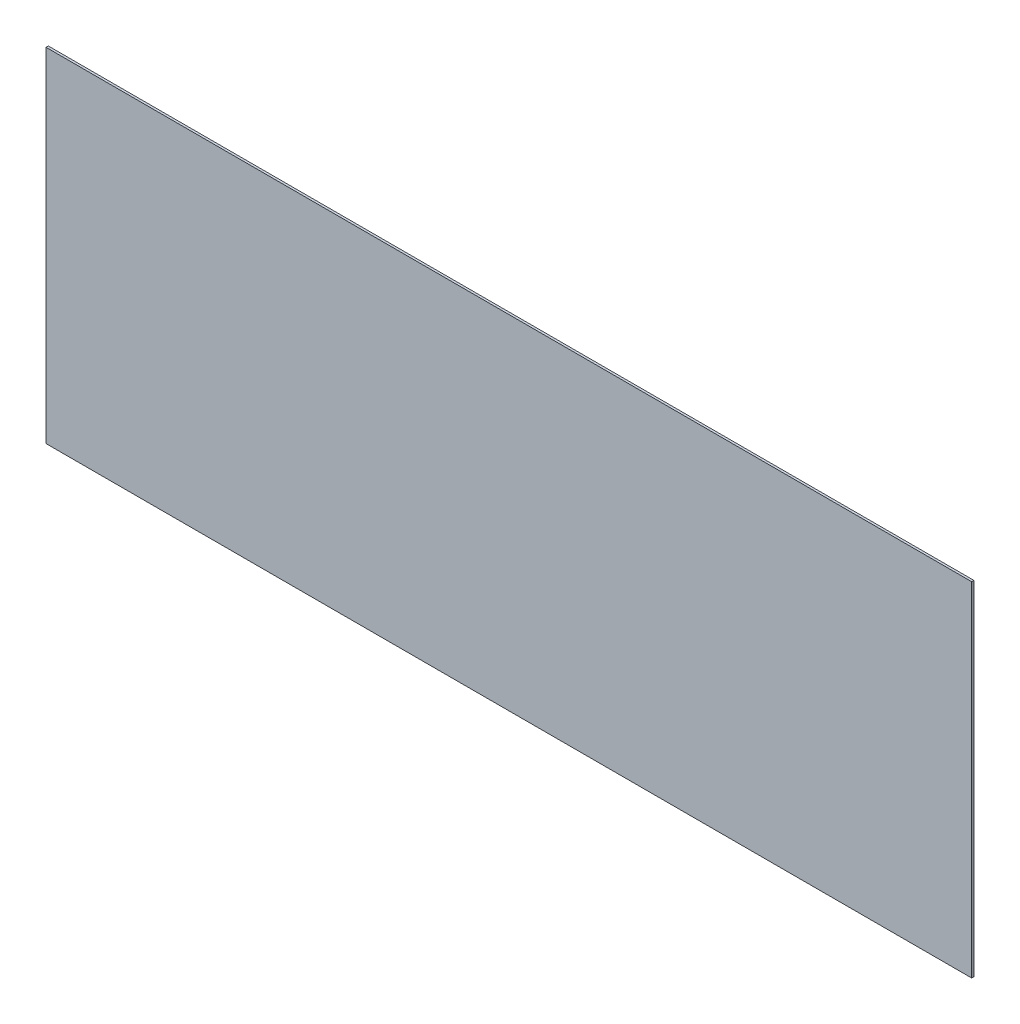
ISO-10303-21;
HEADER;
FILE_DESCRIPTION(('STEP AP214'),'2;1');
FILE_NAME('part.step','',(''),(''),'','','');
FILE_SCHEMA(('AUTOMOTIVE_DESIGN { 1 0 10303 214 1 1 1 1 }'));
ENDSEC;
DATA;
#1=APPLICATION_CONTEXT('core data for automotive mechanical design processes');
#2=APPLICATION_PROTOCOL_DEFINITION('international standard','automotive_design',2000,#1);
#3=PRODUCT_CONTEXT('',#1,'mechanical');
#4=PRODUCT('Part','Part','',(#3));
#5=PRODUCT_RELATED_PRODUCT_CATEGORY('part','',(#4));
#6=PRODUCT_DEFINITION_FORMATION('','',#4);
#7=PRODUCT_DEFINITION_CONTEXT('part definition',#1,'design');
#8=PRODUCT_DEFINITION('design','',#6,#7);
#9=PRODUCT_DEFINITION_SHAPE('','',#8);
#10=(LENGTH_UNIT() NAMED_UNIT(*) SI_UNIT(.MILLI.,.METRE.));
#11=(NAMED_UNIT(*) PLANE_ANGLE_UNIT() SI_UNIT($,.RADIAN.));
#12=(NAMED_UNIT(*) SI_UNIT($,.STERADIAN.) SOLID_ANGLE_UNIT());
#13=UNCERTAINTY_MEASURE_WITH_UNIT(LENGTH_MEASURE(1.E-05),#10,'distance_accuracy_value','');
#14=(GEOMETRIC_REPRESENTATION_CONTEXT(3) GLOBAL_UNCERTAINTY_ASSIGNED_CONTEXT((#13)) GLOBAL_UNIT_ASSIGNED_CONTEXT((#10,
#11,#12)) REPRESENTATION_CONTEXT('',''));
#15=CARTESIAN_POINT('',(0.,0.,0.));
#16=DIRECTION('',(0.,0.,1.));
#17=DIRECTION('',(1.,0.,0.));
#18=AXIS2_PLACEMENT_3D('',#15,#16,#17);
#19=CARTESIAN_POINT('',(609.6,226.06,2.9972));
#20=DIRECTION('',(-1.,0.,0.));
#21=DIRECTION('',(0.,0.,1.));
#22=AXIS2_PLACEMENT_3D('',#19,#20,#21);
#23=PLANE('',#22);
#24=DIRECTION('',(0.,1.,0.));
#25=VECTOR('',#24,1.);
#26=CARTESIAN_POINT('',(609.6,226.06,0.));
#27=LINE('',#26,#25);
#28=CARTESIAN_POINT('',(609.6,-226.06,0.));
#29=VERTEX_POINT('',#28);
#30=CARTESIAN_POINT('',(609.6,226.06,0.));
#31=VERTEX_POINT('',#30);
#32=EDGE_CURVE('E107',#29,#31,#27,.T.);
#33=ORIENTED_EDGE('',*,*,#32,.T.);
#34=DIRECTION('',(0.,0.,-1.));
#35=VECTOR('',#34,1.);
#36=CARTESIAN_POINT('',(609.6,226.06,2.9972));
#37=LINE('',#36,#35);
#38=CARTESIAN_POINT('',(609.6,226.06,2.9972));
#39=VERTEX_POINT('',#38);
#40=EDGE_CURVE('E11',#39,#31,#37,.T.);
#41=ORIENTED_EDGE('',*,*,#40,.F.);
#42=DIRECTION('',(0.,1.,0.));
#43=VECTOR('',#42,1.);
#44=CARTESIAN_POINT('',(609.6,226.06,2.9972));
#45=LINE('',#44,#43);
#46=CARTESIAN_POINT('',(609.6,-226.06,2.9972));
#47=VERTEX_POINT('',#46);
#48=EDGE_CURVE('E91',#47,#39,#45,.T.);
#49=ORIENTED_EDGE('',*,*,#48,.F.);
#50=DIRECTION('',(0.,0.,-1.));
#51=VECTOR('',#50,1.);
#52=CARTESIAN_POINT('',(609.6,-226.06,2.9972));
#53=LINE('',#52,#51);
#54=EDGE_CURVE('E103',#47,#29,#53,.T.);
#55=ORIENTED_EDGE('',*,*,#54,.T.);
#56=EDGE_LOOP('',(#33,#41,#49,#55));
#57=FACE_BOUND('',#56,.T.);
#58=ADVANCED_FACE('F39',(#57),#23,.F.);
#59=CARTESIAN_POINT('',(-609.6,226.06,2.9972));
#60=DIRECTION('',(0.,-1.,0.));
#61=DIRECTION('',(0.,0.,-1.));
#62=AXIS2_PLACEMENT_3D('',#59,#60,#61);
#63=PLANE('',#62);
#64=DIRECTION('',(-1.,0.,0.));
#65=VECTOR('',#64,1.);
#66=CARTESIAN_POINT('',(-609.6,226.06,0.));
#67=LINE('',#66,#65);
#68=CARTESIAN_POINT('',(-609.6,226.06,0.));
#69=VERTEX_POINT('',#68);
#70=EDGE_CURVE('E96',#31,#69,#67,.T.);
#71=ORIENTED_EDGE('',*,*,#70,.T.);
#72=DIRECTION('',(0.,0.,-1.));
#73=VECTOR('',#72,1.);
#74=CARTESIAN_POINT('',(-609.6,226.06,2.9972));
#75=LINE('',#74,#73);
#76=CARTESIAN_POINT('',(-609.6,226.06,2.9972));
#77=VERTEX_POINT('',#76);
#78=EDGE_CURVE('E48',#77,#69,#75,.T.);
#79=ORIENTED_EDGE('',*,*,#78,.F.);
#80=DIRECTION('',(-1.,0.,0.));
#81=VECTOR('',#80,1.);
#82=CARTESIAN_POINT('',(-609.6,226.06,2.9972));
#83=LINE('',#82,#81);
#84=EDGE_CURVE('E86',#39,#77,#83,.T.);
#85=ORIENTED_EDGE('',*,*,#84,.F.);
#86=ORIENTED_EDGE('',*,*,#40,.T.);
#87=EDGE_LOOP('',(#71,#79,#85,#86));
#88=FACE_BOUND('',#87,.T.);
#89=ADVANCED_FACE('F95',(#88),#63,.F.);
#90=CARTESIAN_POINT('',(-609.6,226.06,2.9972));
#91=DIRECTION('',(1.,0.,0.));
#92=DIRECTION('',(0.,1.,0.));
#93=AXIS2_PLACEMENT_3D('',#90,#91,#92);
#94=PLANE('',#93);
#95=DIRECTION('',(0.,-1.,0.));
#96=VECTOR('',#95,1.);
#97=CARTESIAN_POINT('',(-609.6,226.06,0.));
#98=LINE('',#97,#96);
#99=CARTESIAN_POINT('',(-609.6,-226.06,0.));
#100=VERTEX_POINT('',#99);
#101=EDGE_CURVE('E73',#69,#100,#98,.T.);
#102=ORIENTED_EDGE('',*,*,#101,.T.);
#103=DIRECTION('',(0.,0.,-1.));
#104=VECTOR('',#103,1.);
#105=CARTESIAN_POINT('',(-609.6,-226.06,2.9972));
#106=LINE('',#105,#104);
#107=CARTESIAN_POINT('',(-609.6,-226.06,2.9972));
#108=VERTEX_POINT('',#107);
#109=EDGE_CURVE('E98',#108,#100,#106,.T.);
#110=ORIENTED_EDGE('',*,*,#109,.F.);
#111=DIRECTION('',(0.,-1.,0.));
#112=VECTOR('',#111,1.);
#113=CARTESIAN_POINT('',(-609.6,226.06,2.9972));
#114=LINE('',#113,#112);
#115=EDGE_CURVE('E89',#77,#108,#114,.T.);
#116=ORIENTED_EDGE('',*,*,#115,.F.);
#117=ORIENTED_EDGE('',*,*,#78,.T.);
#118=EDGE_LOOP('',(#102,#110,#116,#117));
#119=FACE_BOUND('',#118,.T.);
#120=ADVANCED_FACE('F99',(#119),#94,.F.);
#121=CARTESIAN_POINT('',(-609.6,-226.06,2.9972));
#122=DIRECTION('',(0.,1.,0.));
#123=DIRECTION('',(0.,0.,1.));
#124=AXIS2_PLACEMENT_3D('',#121,#122,#123);
#125=PLANE('',#124);
#126=DIRECTION('',(1.,0.,0.));
#127=VECTOR('',#126,1.);
#128=CARTESIAN_POINT('',(-609.6,-226.06,0.));
#129=LINE('',#128,#127);
#130=EDGE_CURVE('E79',#100,#29,#129,.T.);
#131=ORIENTED_EDGE('',*,*,#130,.T.);
#132=ORIENTED_EDGE('',*,*,#54,.F.);
#133=DIRECTION('',(1.,0.,0.));
#134=VECTOR('',#133,1.);
#135=CARTESIAN_POINT('',(-609.6,-226.06,2.9972));
#136=LINE('',#135,#134);
#137=EDGE_CURVE('E56',#108,#47,#136,.T.);
#138=ORIENTED_EDGE('',*,*,#137,.F.);
#139=ORIENTED_EDGE('',*,*,#109,.T.);
#140=EDGE_LOOP('',(#131,#132,#138,#139));
#141=FACE_BOUND('',#140,.T.);
#142=ADVANCED_FACE('F120',(#141),#125,.F.);
#143=CARTESIAN_POINT('',(0.,0.,2.9972));
#144=DIRECTION('',(0.,0.,1.));
#145=DIRECTION('',(1.,0.,0.));
#146=AXIS2_PLACEMENT_3D('',#143,#144,#145);
#147=PLANE('',#146);
#148=ORIENTED_EDGE('',*,*,#48,.T.);
#149=ORIENTED_EDGE('',*,*,#84,.T.);
#150=ORIENTED_EDGE('',*,*,#115,.T.);
#151=ORIENTED_EDGE('',*,*,#137,.T.);
#152=EDGE_LOOP('',(#148,#149,#150,#151));
#153=FACE_BOUND('',#152,.T.);
#154=ADVANCED_FACE('F87',(#153),#147,.T.);
#155=CARTESIAN_POINT('',(0.,0.,0.));
#156=DIRECTION('',(0.,0.,1.));
#157=DIRECTION('',(1.,0.,0.));
#158=AXIS2_PLACEMENT_3D('',#155,#156,#157);
#159=PLANE('',#158);
#160=ORIENTED_EDGE('',*,*,#32,.F.);
#161=ORIENTED_EDGE('',*,*,#130,.F.);
#162=ORIENTED_EDGE('',*,*,#101,.F.);
#163=ORIENTED_EDGE('',*,*,#70,.F.);
#164=EDGE_LOOP('',(#160,#161,#162,#163));
#165=FACE_BOUND('',#164,.T.);
#166=ADVANCED_FACE('F123',(#165),#159,.F.);
#167=CLOSED_SHELL('',(#58,#89,#120,#142,#154,#166));
#168=MANIFOLD_SOLID_BREP('B2',#167);
#169=ADVANCED_BREP_SHAPE_REPRESENTATION('',(#18,#168),#14);
#170=SHAPE_DEFINITION_REPRESENTATION(#9,#169);
ENDSEC;
END-ISO-10303-21;
